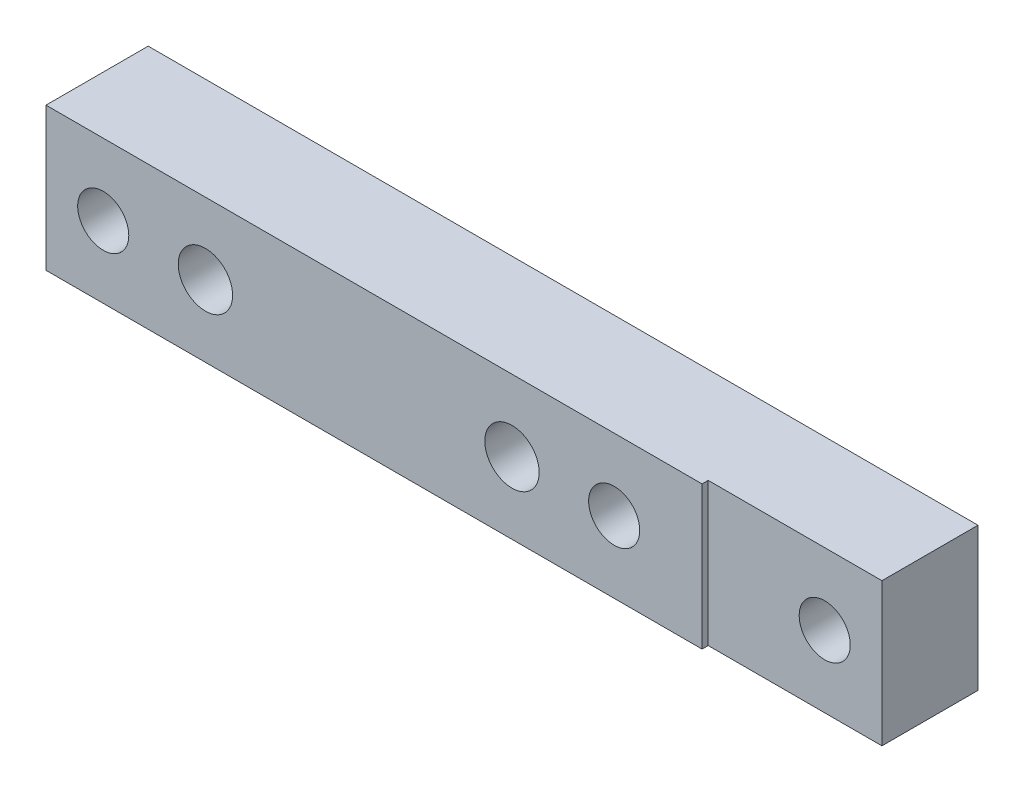
ISO-10303-21;
HEADER;
FILE_DESCRIPTION(('STEP AP214'),'2;1');
FILE_NAME('part.step','',(''),(''),'','','');
FILE_SCHEMA(('AUTOMOTIVE_DESIGN { 1 0 10303 214 1 1 1 1 }'));
ENDSEC;
DATA;
#1=APPLICATION_CONTEXT('core data for automotive mechanical design processes');
#2=APPLICATION_PROTOCOL_DEFINITION('international standard','automotive_design',2000,#1);
#3=PRODUCT_CONTEXT('',#1,'mechanical');
#4=PRODUCT('Part','Part','',(#3));
#5=PRODUCT_RELATED_PRODUCT_CATEGORY('part','',(#4));
#6=PRODUCT_DEFINITION_FORMATION('','',#4);
#7=PRODUCT_DEFINITION_CONTEXT('part definition',#1,'design');
#8=PRODUCT_DEFINITION('design','',#6,#7);
#9=PRODUCT_DEFINITION_SHAPE('','',#8);
#10=(LENGTH_UNIT() NAMED_UNIT(*) SI_UNIT(.MILLI.,.METRE.));
#11=(NAMED_UNIT(*) PLANE_ANGLE_UNIT() SI_UNIT($,.RADIAN.));
#12=(NAMED_UNIT(*) SI_UNIT($,.STERADIAN.) SOLID_ANGLE_UNIT());
#13=UNCERTAINTY_MEASURE_WITH_UNIT(LENGTH_MEASURE(1.E-05),#10,'distance_accuracy_value','');
#14=(GEOMETRIC_REPRESENTATION_CONTEXT(3) GLOBAL_UNCERTAINTY_ASSIGNED_CONTEXT((#13)) GLOBAL_UNIT_ASSIGNED_CONTEXT((#10,
#11,#12)) REPRESENTATION_CONTEXT('',''));
#15=CARTESIAN_POINT('',(0.,0.,0.));
#16=DIRECTION('',(0.,0.,1.));
#17=DIRECTION('',(1.,0.,0.));
#18=AXIS2_PLACEMENT_3D('',#15,#16,#17);
#19=CARTESIAN_POINT('',(-70.612,8.88999999999999,-12.7));
#20=DIRECTION('',(0.,1.,0.));
#21=DIRECTION('',(-1.,0.,0.));
#22=AXIS2_PLACEMENT_3D('',#19,#20,#21);
#23=PLANE('',#22);
#24=DIRECTION('',(-1.,0.,0.));
#25=VECTOR('',#24,1.);
#26=CARTESIAN_POINT('',(-70.612,8.88999999999999,0.));
#27=LINE('',#26,#25);
#28=CARTESIAN_POINT('',(10.922,8.89,0.));
#29=VERTEX_POINT('',#28);
#30=CARTESIAN_POINT('',(-70.612,8.88999999999999,0.));
#31=VERTEX_POINT('',#30);
#32=EDGE_CURVE('E90',#29,#31,#27,.T.);
#33=ORIENTED_EDGE('',*,*,#32,.F.);
#34=DIRECTION('',(0.,0.,1.));
#35=VECTOR('',#34,1.);
#36=CARTESIAN_POINT('',(10.922,8.88999999999998,-0.762));
#37=LINE('',#36,#35);
#38=CARTESIAN_POINT('',(10.922,8.88999999999998,-0.762));
#39=VERTEX_POINT('',#38);
#40=EDGE_CURVE('E67',#39,#29,#37,.T.);
#41=ORIENTED_EDGE('',*,*,#40,.F.);
#42=DIRECTION('',(1.,0.,0.));
#43=VECTOR('',#42,1.);
#44=CARTESIAN_POINT('',(10.922,8.88999999999998,-0.762));
#45=LINE('',#44,#43);
#46=CARTESIAN_POINT('',(32.512,8.89,-0.762));
#47=VERTEX_POINT('',#46);
#48=EDGE_CURVE('E119',#39,#47,#45,.T.);
#49=ORIENTED_EDGE('',*,*,#48,.T.);
#50=DIRECTION('',(0.,0.,1.));
#51=VECTOR('',#50,1.);
#52=CARTESIAN_POINT('',(32.512,8.89,-12.7));
#53=LINE('',#52,#51);
#54=CARTESIAN_POINT('',(32.512,8.89,-12.7));
#55=VERTEX_POINT('',#54);
#56=EDGE_CURVE('E59',#55,#47,#53,.T.);
#57=ORIENTED_EDGE('',*,*,#56,.F.);
#58=DIRECTION('',(-1.,0.,0.));
#59=VECTOR('',#58,1.);
#60=CARTESIAN_POINT('',(-70.612,8.88999999999999,-12.7));
#61=LINE('',#60,#59);
#62=CARTESIAN_POINT('',(-70.612,8.88999999999999,-12.7));
#63=VERTEX_POINT('',#62);
#64=EDGE_CURVE('E139',#55,#63,#61,.T.);
#65=ORIENTED_EDGE('',*,*,#64,.T.);
#66=DIRECTION('',(0.,0.,1.));
#67=VECTOR('',#66,1.);
#68=CARTESIAN_POINT('',(-70.612,8.88999999999999,-12.7));
#69=LINE('',#68,#67);
#70=EDGE_CURVE('E13',#63,#31,#69,.T.);
#71=ORIENTED_EDGE('',*,*,#70,.T.);
#72=EDGE_LOOP('',(#33,#41,#49,#57,#65,#71));
#73=FACE_BOUND('',#72,.T.);
#74=ADVANCED_FACE('F50',(#73),#23,.T.);
#75=CARTESIAN_POINT('',(-70.612,-8.89000000000001,-12.7));
#76=DIRECTION('',(0.,-1.,0.));
#77=DIRECTION('',(1.,0.,0.));
#78=AXIS2_PLACEMENT_3D('',#75,#76,#77);
#79=PLANE('',#78);
#80=DIRECTION('',(-1.,0.,0.));
#81=VECTOR('',#80,1.);
#82=CARTESIAN_POINT('',(32.512,-8.89,-0.762));
#83=LINE('',#82,#81);
#84=CARTESIAN_POINT('',(32.512,-8.89,-0.762));
#85=VERTEX_POINT('',#84);
#86=CARTESIAN_POINT('',(10.922,-8.89000000000001,-0.762));
#87=VERTEX_POINT('',#86);
#88=EDGE_CURVE('E121',#85,#87,#83,.T.);
#89=ORIENTED_EDGE('',*,*,#88,.T.);
#90=DIRECTION('',(0.,0.,1.));
#91=VECTOR('',#90,1.);
#92=CARTESIAN_POINT('',(10.922,-8.89000000000001,-0.762));
#93=LINE('',#92,#91);
#94=CARTESIAN_POINT('',(10.922,-8.89000000000001,0.));
#95=VERTEX_POINT('',#94);
#96=EDGE_CURVE('E167',#87,#95,#93,.T.);
#97=ORIENTED_EDGE('',*,*,#96,.T.);
#98=DIRECTION('',(1.,0.,0.));
#99=VECTOR('',#98,1.);
#100=CARTESIAN_POINT('',(-70.612,-8.89000000000001,0.));
#101=LINE('',#100,#99);
#102=CARTESIAN_POINT('',(-70.612,-8.89000000000001,0.));
#103=VERTEX_POINT('',#102);
#104=EDGE_CURVE('E147',#103,#95,#101,.T.);
#105=ORIENTED_EDGE('',*,*,#104,.F.);
#106=DIRECTION('',(0.,0.,1.));
#107=VECTOR('',#106,1.);
#108=CARTESIAN_POINT('',(-70.612,-8.89000000000001,-12.7));
#109=LINE('',#108,#107);
#110=CARTESIAN_POINT('',(-70.612,-8.89000000000001,-12.7));
#111=VERTEX_POINT('',#110);
#112=EDGE_CURVE('E96',#111,#103,#109,.T.);
#113=ORIENTED_EDGE('',*,*,#112,.F.);
#114=DIRECTION('',(1.,0.,0.));
#115=VECTOR('',#114,1.);
#116=CARTESIAN_POINT('',(-70.612,-8.89000000000001,-12.7));
#117=LINE('',#116,#115);
#118=CARTESIAN_POINT('',(32.512,-8.89,-12.7));
#119=VERTEX_POINT('',#118);
#120=EDGE_CURVE('E141',#111,#119,#117,.T.);
#121=ORIENTED_EDGE('',*,*,#120,.T.);
#122=DIRECTION('',(0.,0.,1.));
#123=VECTOR('',#122,1.);
#124=CARTESIAN_POINT('',(32.512,-8.89,-12.7));
#125=LINE('',#124,#123);
#126=EDGE_CURVE('E135',#119,#85,#125,.T.);
#127=ORIENTED_EDGE('',*,*,#126,.T.);
#128=EDGE_LOOP('',(#89,#97,#105,#113,#121,#127));
#129=FACE_BOUND('',#128,.T.);
#130=ADVANCED_FACE('F193',(#129),#79,.T.);
#131=CARTESIAN_POINT('',(0.,0.,0.));
#132=DIRECTION('',(0.,0.,1.));
#133=DIRECTION('',(1.,0.,0.));
#134=AXIS2_PLACEMENT_3D('',#131,#132,#133);
#135=PLANE('',#134);
#136=CARTESIAN_POINT('',(-50.8,0.,0.));
#137=DIRECTION('',(0.,0.,1.));
#138=DIRECTION('',(1.,0.,0.));
#139=AXIS2_PLACEMENT_3D('',#136,#137,#138);
#140=CIRCLE('',#139,3.37819999999998);
#141=CARTESIAN_POINT('',(-47.4218,0.,0.));
#142=VERTEX_POINT('',#141);
#143=EDGE_CURVE('E184',#142,#142,#140,.T.);
#144=ORIENTED_EDGE('',*,*,#143,.F.);
#145=EDGE_LOOP('',(#144));
#146=FACE_BOUND('',#145,.T.);
#147=CARTESIAN_POINT('',(-12.7,0.,0.));
#148=DIRECTION('',(0.,0.,1.));
#149=DIRECTION('',(1.,0.,0.));
#150=AXIS2_PLACEMENT_3D('',#147,#148,#149);
#151=CIRCLE('',#150,3.37819999999999);
#152=CARTESIAN_POINT('',(-9.32180000000002,0.,0.));
#153=VERTEX_POINT('',#152);
#154=EDGE_CURVE('E178',#153,#153,#151,.T.);
#155=ORIENTED_EDGE('',*,*,#154,.F.);
#156=EDGE_LOOP('',(#155));
#157=FACE_BOUND('',#156,.T.);
#158=CARTESIAN_POINT('',(-63.5,0.,0.));
#159=DIRECTION('',(0.,0.,1.));
#160=DIRECTION('',(1.,0.,0.));
#161=AXIS2_PLACEMENT_3D('',#158,#159,#160);
#162=CIRCLE('',#161,3.175);
#163=CARTESIAN_POINT('',(-60.325,0.,0.));
#164=VERTEX_POINT('',#163);
#165=EDGE_CURVE('E153',#164,#164,#162,.T.);
#166=ORIENTED_EDGE('',*,*,#165,.F.);
#167=EDGE_LOOP('',(#166));
#168=FACE_BOUND('',#167,.T.);
#169=CARTESIAN_POINT('',(0.,0.,0.));
#170=DIRECTION('',(0.,0.,1.));
#171=DIRECTION('',(1.,0.,0.));
#172=AXIS2_PLACEMENT_3D('',#169,#170,#171);
#173=CIRCLE('',#172,3.175);
#174=CARTESIAN_POINT('',(3.175,0.,0.));
#175=VERTEX_POINT('',#174);
#176=EDGE_CURVE('E159',#175,#175,#173,.T.);
#177=ORIENTED_EDGE('',*,*,#176,.F.);
#178=EDGE_LOOP('',(#177));
#179=FACE_BOUND('',#178,.T.);
#180=ORIENTED_EDGE('',*,*,#104,.T.);
#181=DIRECTION('',(0.,1.,0.));
#182=VECTOR('',#181,1.);
#183=CARTESIAN_POINT('',(10.922,-8.89000000000001,0.));
#184=LINE('',#183,#182);
#185=EDGE_CURVE('E130',#95,#29,#184,.T.);
#186=ORIENTED_EDGE('',*,*,#185,.T.);
#187=ORIENTED_EDGE('',*,*,#32,.T.);
#188=DIRECTION('',(0.,-1.,0.));
#189=VECTOR('',#188,1.);
#190=CARTESIAN_POINT('',(-70.612,8.88999999999999,0.));
#191=LINE('',#190,#189);
#192=EDGE_CURVE('E145',#31,#103,#191,.T.);
#193=ORIENTED_EDGE('',*,*,#192,.T.);
#194=EDGE_LOOP('',(#180,#186,#187,#193));
#195=FACE_BOUND('',#194,.T.);
#196=ADVANCED_FACE('F190',(#146,#157,#168,#179,#195),#135,.T.);
#197=CARTESIAN_POINT('',(-70.612,8.88999999999999,-12.7));
#198=DIRECTION('',(-1.,0.,0.));
#199=DIRECTION('',(0.,0.,1.));
#200=AXIS2_PLACEMENT_3D('',#197,#198,#199);
#201=PLANE('',#200);
#202=ORIENTED_EDGE('',*,*,#192,.F.);
#203=ORIENTED_EDGE('',*,*,#70,.F.);
#204=DIRECTION('',(0.,-1.,0.));
#205=VECTOR('',#204,1.);
#206=CARTESIAN_POINT('',(-70.612,8.88999999999999,-12.7));
#207=LINE('',#206,#205);
#208=EDGE_CURVE('E150',#63,#111,#207,.T.);
#209=ORIENTED_EDGE('',*,*,#208,.T.);
#210=ORIENTED_EDGE('',*,*,#112,.T.);
#211=EDGE_LOOP('',(#202,#203,#209,#210));
#212=FACE_BOUND('',#211,.T.);
#213=ADVANCED_FACE('F52',(#212),#201,.T.);
#214=CARTESIAN_POINT('',(32.512,8.89,-12.7));
#215=DIRECTION('',(1.,0.,0.));
#216=DIRECTION('',(0.,1.,0.));
#217=AXIS2_PLACEMENT_3D('',#214,#215,#216);
#218=PLANE('',#217);
#219=DIRECTION('',(0.,-1.,0.));
#220=VECTOR('',#219,1.);
#221=CARTESIAN_POINT('',(32.512,8.89,-0.762));
#222=LINE('',#221,#220);
#223=EDGE_CURVE('E114',#47,#85,#222,.T.);
#224=ORIENTED_EDGE('',*,*,#223,.T.);
#225=ORIENTED_EDGE('',*,*,#126,.F.);
#226=DIRECTION('',(0.,1.,0.));
#227=VECTOR('',#226,1.);
#228=CARTESIAN_POINT('',(32.512,0.,-12.7));
#229=LINE('',#228,#227);
#230=EDGE_CURVE('E134',#119,#55,#229,.T.);
#231=ORIENTED_EDGE('',*,*,#230,.T.);
#232=ORIENTED_EDGE('',*,*,#56,.T.);
#233=EDGE_LOOP('',(#224,#225,#231,#232));
#234=FACE_BOUND('',#233,.T.);
#235=ADVANCED_FACE('F132',(#234),#218,.T.);
#236=CARTESIAN_POINT('',(0.,0.,-12.7));
#237=DIRECTION('',(0.,0.,1.));
#238=DIRECTION('',(1.,0.,0.));
#239=AXIS2_PLACEMENT_3D('',#236,#237,#238);
#240=PLANE('',#239);
#241=CARTESIAN_POINT('',(-50.8,0.,-12.7));
#242=DIRECTION('',(0.,0.,1.));
#243=DIRECTION('',(1.,0.,0.));
#244=AXIS2_PLACEMENT_3D('',#241,#242,#243);
#245=CIRCLE('',#244,3.37819999999999);
#246=CARTESIAN_POINT('',(-47.4218,0.,-12.7));
#247=VERTEX_POINT('',#246);
#248=EDGE_CURVE('E181',#247,#247,#245,.T.);
#249=ORIENTED_EDGE('',*,*,#248,.T.);
#250=EDGE_LOOP('',(#249));
#251=FACE_BOUND('',#250,.T.);
#252=CARTESIAN_POINT('',(-12.7,0.,-12.7));
#253=DIRECTION('',(0.,0.,1.));
#254=DIRECTION('',(1.,0.,0.));
#255=AXIS2_PLACEMENT_3D('',#252,#253,#254);
#256=CIRCLE('',#255,3.37819999999999);
#257=CARTESIAN_POINT('',(-9.32180000000001,0.,-12.7));
#258=VERTEX_POINT('',#257);
#259=EDGE_CURVE('E173',#258,#258,#256,.T.);
#260=ORIENTED_EDGE('',*,*,#259,.T.);
#261=EDGE_LOOP('',(#260));
#262=FACE_BOUND('',#261,.T.);
#263=CARTESIAN_POINT('',(25.4,0.,-12.7));
#264=DIRECTION('',(0.,0.,1.));
#265=DIRECTION('',(1.,0.,0.));
#266=AXIS2_PLACEMENT_3D('',#263,#264,#265);
#267=CIRCLE('',#266,3.175);
#268=CARTESIAN_POINT('',(28.575,0.,-12.7));
#269=VERTEX_POINT('',#268);
#270=EDGE_CURVE('E162',#269,#269,#267,.T.);
#271=ORIENTED_EDGE('',*,*,#270,.T.);
#272=EDGE_LOOP('',(#271));
#273=FACE_BOUND('',#272,.T.);
#274=CARTESIAN_POINT('',(0.,0.,-12.7));
#275=DIRECTION('',(0.,0.,1.));
#276=DIRECTION('',(1.,0.,0.));
#277=AXIS2_PLACEMENT_3D('',#274,#275,#276);
#278=CIRCLE('',#277,3.175);
#279=CARTESIAN_POINT('',(3.175,0.,-12.7));
#280=VERTEX_POINT('',#279);
#281=EDGE_CURVE('E156',#280,#280,#278,.T.);
#282=ORIENTED_EDGE('',*,*,#281,.T.);
#283=EDGE_LOOP('',(#282));
#284=FACE_BOUND('',#283,.T.);
#285=CARTESIAN_POINT('',(-63.5,0.,-12.7));
#286=DIRECTION('',(0.,0.,1.));
#287=DIRECTION('',(1.,0.,0.));
#288=AXIS2_PLACEMENT_3D('',#285,#286,#287);
#289=CIRCLE('',#288,3.175);
#290=CARTESIAN_POINT('',(-60.325,0.,-12.7));
#291=VERTEX_POINT('',#290);
#292=EDGE_CURVE('E148',#291,#291,#289,.T.);
#293=ORIENTED_EDGE('',*,*,#292,.T.);
#294=EDGE_LOOP('',(#293));
#295=FACE_BOUND('',#294,.T.);
#296=ORIENTED_EDGE('',*,*,#208,.F.);
#297=ORIENTED_EDGE('',*,*,#64,.F.);
#298=ORIENTED_EDGE('',*,*,#230,.F.);
#299=ORIENTED_EDGE('',*,*,#120,.F.);
#300=EDGE_LOOP('',(#296,#297,#298,#299));
#301=FACE_BOUND('',#300,.T.);
#302=ADVANCED_FACE('F221',(#251,#262,#273,#284,#295,#301),#240,.F.);
#303=CARTESIAN_POINT('',(-63.5,0.,-12.7));
#304=DIRECTION('',(0.,0.,1.));
#305=DIRECTION('',(1.,0.,0.));
#306=AXIS2_PLACEMENT_3D('',#303,#304,#305);
#307=CYLINDRICAL_SURFACE('',#306,3.175);
#308=ORIENTED_EDGE('',*,*,#292,.F.);
#309=EDGE_LOOP('',(#308));
#310=FACE_BOUND('',#309,.T.);
#311=ORIENTED_EDGE('',*,*,#165,.T.);
#312=EDGE_LOOP('',(#311));
#313=FACE_BOUND('',#312,.T.);
#314=ADVANCED_FACE('F226',(#310,#313),#307,.F.);
#315=CARTESIAN_POINT('',(0.,0.,-12.7));
#316=DIRECTION('',(0.,0.,1.));
#317=DIRECTION('',(1.,0.,0.));
#318=AXIS2_PLACEMENT_3D('',#315,#316,#317);
#319=CYLINDRICAL_SURFACE('',#318,3.175);
#320=ORIENTED_EDGE('',*,*,#281,.F.);
#321=EDGE_LOOP('',(#320));
#322=FACE_BOUND('',#321,.T.);
#323=ORIENTED_EDGE('',*,*,#176,.T.);
#324=EDGE_LOOP('',(#323));
#325=FACE_BOUND('',#324,.T.);
#326=ADVANCED_FACE('F258',(#322,#325),#319,.F.);
#327=CARTESIAN_POINT('',(25.4,0.,-12.7));
#328=DIRECTION('',(0.,0.,1.));
#329=DIRECTION('',(1.,0.,0.));
#330=AXIS2_PLACEMENT_3D('',#327,#328,#329);
#331=CYLINDRICAL_SURFACE('',#330,3.175);
#332=CARTESIAN_POINT('',(25.4,0.,-0.762000000000001));
#333=DIRECTION('',(0.,0.,-1.));
#334=DIRECTION('',(-1.,0.,0.));
#335=AXIS2_PLACEMENT_3D('',#332,#333,#334);
#336=CIRCLE('',#335,3.175);
#337=CARTESIAN_POINT('',(22.225,0.,-0.762000000000001));
#338=VERTEX_POINT('',#337);
#339=EDGE_CURVE('E54',#338,#338,#336,.F.);
#340=ORIENTED_EDGE('',*,*,#339,.T.);
#341=EDGE_LOOP('',(#340));
#342=FACE_BOUND('',#341,.T.);
#343=ORIENTED_EDGE('',*,*,#270,.F.);
#344=EDGE_LOOP('',(#343));
#345=FACE_BOUND('',#344,.T.);
#346=ADVANCED_FACE('F210',(#342,#345),#331,.F.);
#347=CARTESIAN_POINT('',(0.,0.,-0.762));
#348=DIRECTION('',(0.,0.,-1.));
#349=DIRECTION('',(-1.,0.,0.));
#350=AXIS2_PLACEMENT_3D('',#347,#348,#349);
#351=PLANE('',#350);
#352=ORIENTED_EDGE('',*,*,#48,.F.);
#353=DIRECTION('',(0.,1.,0.));
#354=VECTOR('',#353,1.);
#355=CARTESIAN_POINT('',(10.922,-8.89000000000001,-0.762));
#356=LINE('',#355,#354);
#357=EDGE_CURVE('E171',#87,#39,#356,.T.);
#358=ORIENTED_EDGE('',*,*,#357,.F.);
#359=ORIENTED_EDGE('',*,*,#88,.F.);
#360=ORIENTED_EDGE('',*,*,#223,.F.);
#361=EDGE_LOOP('',(#352,#358,#359,#360));
#362=FACE_BOUND('',#361,.T.);
#363=ORIENTED_EDGE('',*,*,#339,.F.);
#364=EDGE_LOOP('',(#363));
#365=FACE_BOUND('',#364,.T.);
#366=ADVANCED_FACE('F116',(#362,#365),#351,.F.);
#367=CARTESIAN_POINT('',(10.922,-8.89000000000001,-0.762));
#368=DIRECTION('',(1.,0.,0.));
#369=DIRECTION('',(0.,1.,0.));
#370=AXIS2_PLACEMENT_3D('',#367,#368,#369);
#371=PLANE('',#370);
#372=ORIENTED_EDGE('',*,*,#185,.F.);
#373=ORIENTED_EDGE('',*,*,#96,.F.);
#374=ORIENTED_EDGE('',*,*,#357,.T.);
#375=ORIENTED_EDGE('',*,*,#40,.T.);
#376=EDGE_LOOP('',(#372,#373,#374,#375));
#377=FACE_BOUND('',#376,.T.);
#378=ADVANCED_FACE('F200',(#377),#371,.T.);
#379=CARTESIAN_POINT('',(-12.7,0.,0.));
#380=DIRECTION('',(0.,0.,1.));
#381=DIRECTION('',(1.,0.,0.));
#382=AXIS2_PLACEMENT_3D('',#379,#380,#381);
#383=CYLINDRICAL_SURFACE('',#382,3.37819999999999);
#384=ORIENTED_EDGE('',*,*,#259,.F.);
#385=EDGE_LOOP('',(#384));
#386=FACE_BOUND('',#385,.T.);
#387=ORIENTED_EDGE('',*,*,#154,.T.);
#388=EDGE_LOOP('',(#387));
#389=FACE_BOUND('',#388,.T.);
#390=ADVANCED_FACE('F202',(#386,#389),#383,.F.);
#391=CARTESIAN_POINT('',(-50.8,0.,0.));
#392=DIRECTION('',(0.,0.,1.));
#393=DIRECTION('',(1.,0.,0.));
#394=AXIS2_PLACEMENT_3D('',#391,#392,#393);
#395=CYLINDRICAL_SURFACE('',#394,3.37819999999999);
#396=ORIENTED_EDGE('',*,*,#248,.F.);
#397=EDGE_LOOP('',(#396));
#398=FACE_BOUND('',#397,.T.);
#399=ORIENTED_EDGE('',*,*,#143,.T.);
#400=EDGE_LOOP('',(#399));
#401=FACE_BOUND('',#400,.T.);
#402=ADVANCED_FACE('F188',(#398,#401),#395,.F.);
#403=CLOSED_SHELL('',(#74,#130,#196,#213,#235,#302,#314,#326,#346,#366,#378,#390,#402));
#404=MANIFOLD_SOLID_BREP('B2',#403);
#405=ADVANCED_BREP_SHAPE_REPRESENTATION('',(#18,#404),#14);
#406=SHAPE_DEFINITION_REPRESENTATION(#9,#405);
ENDSEC;
END-ISO-10303-21;
